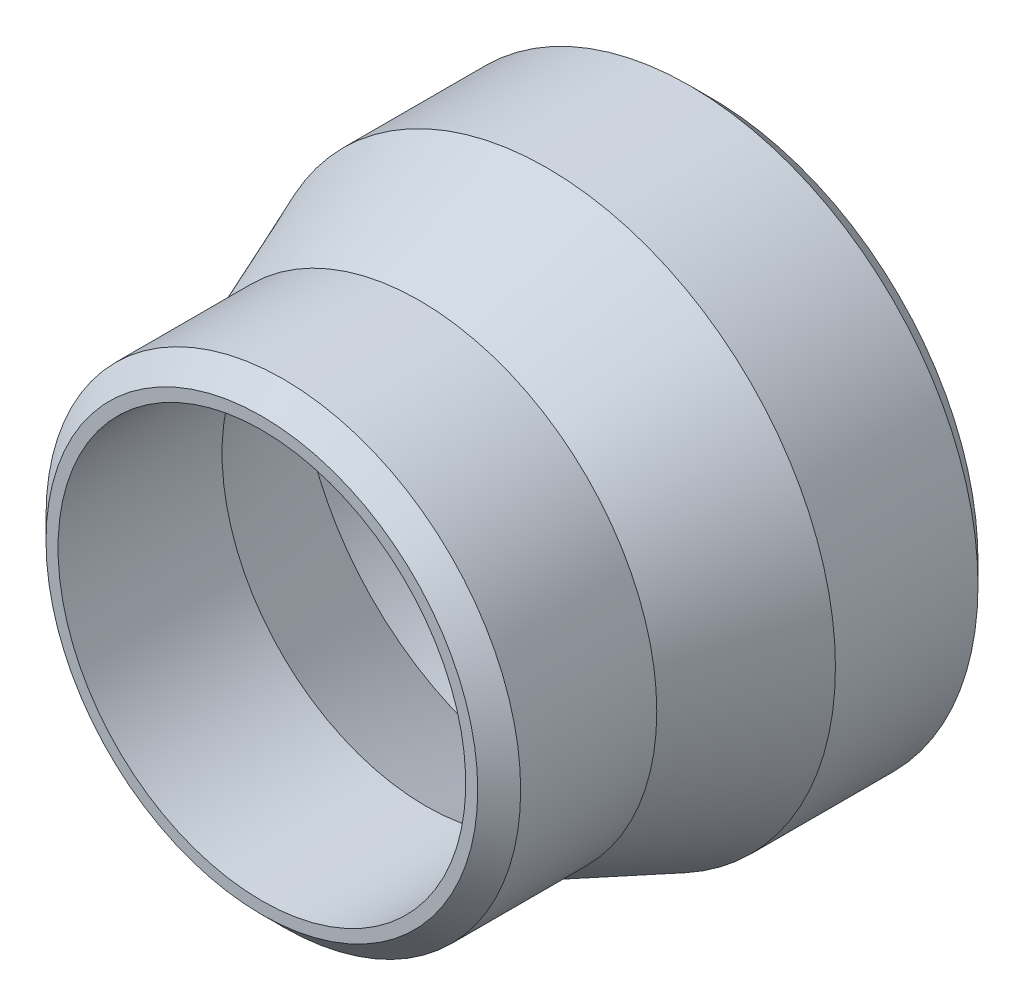
ISO-10303-21;
HEADER;
FILE_DESCRIPTION(('STEP AP214'),'2;1');
FILE_NAME('part.step','',(''),(''),'','','');
FILE_SCHEMA(('AUTOMOTIVE_DESIGN { 1 0 10303 214 1 1 1 1 }'));
ENDSEC;
DATA;
#1=APPLICATION_CONTEXT('core data for automotive mechanical design processes');
#2=APPLICATION_PROTOCOL_DEFINITION('international standard','automotive_design',2000,#1);
#3=PRODUCT_CONTEXT('',#1,'mechanical');
#4=PRODUCT('Part','Part','',(#3));
#5=PRODUCT_RELATED_PRODUCT_CATEGORY('part','',(#4));
#6=PRODUCT_DEFINITION_FORMATION('','',#4);
#7=PRODUCT_DEFINITION_CONTEXT('part definition',#1,'design');
#8=PRODUCT_DEFINITION('design','',#6,#7);
#9=PRODUCT_DEFINITION_SHAPE('','',#8);
#10=(LENGTH_UNIT() NAMED_UNIT(*) SI_UNIT(.MILLI.,.METRE.));
#11=(NAMED_UNIT(*) PLANE_ANGLE_UNIT() SI_UNIT($,.RADIAN.));
#12=(NAMED_UNIT(*) SI_UNIT($,.STERADIAN.) SOLID_ANGLE_UNIT());
#13=UNCERTAINTY_MEASURE_WITH_UNIT(LENGTH_MEASURE(1.E-05),#10,'distance_accuracy_value','');
#14=(GEOMETRIC_REPRESENTATION_CONTEXT(3) GLOBAL_UNCERTAINTY_ASSIGNED_CONTEXT((#13)) GLOBAL_UNIT_ASSIGNED_CONTEXT((#10,
#11,#12)) REPRESENTATION_CONTEXT('',''));
#15=CARTESIAN_POINT('',(0.,0.,0.));
#16=DIRECTION('',(0.,0.,1.));
#17=DIRECTION('',(1.,0.,0.));
#18=AXIS2_PLACEMENT_3D('',#15,#16,#17);
#19=CARTESIAN_POINT('',(0.,-1.86260373221868E-13,53.18125));
#20=DIRECTION('',(0.,0.,-1.));
#21=DIRECTION('',(0.,1.,0.));
#22=AXIS2_PLACEMENT_3D('',#19,#20,#21);
#23=PLANE('',#22);
#24=CARTESIAN_POINT('',(0.,0.,53.18125));
#25=DIRECTION('',(0.,0.,-1.));
#26=DIRECTION('',(0.,1.,0.));
#27=AXIS2_PLACEMENT_3D('',#24,#25,#26);
#28=CIRCLE('',#27,25.5524);
#29=CARTESIAN_POINT('',(0.,25.5524,53.18125));
#30=VERTEX_POINT('',#29);
#31=EDGE_CURVE('E10',#30,#30,#28,.F.);
#32=ORIENTED_EDGE('',*,*,#31,.T.);
#33=EDGE_LOOP('',(#32));
#34=FACE_BOUND('',#33,.T.);
#35=CARTESIAN_POINT('',(0.,0.,53.18125));
#36=DIRECTION('',(0.,0.,-1.));
#37=DIRECTION('',(0.,1.,0.));
#38=AXIS2_PLACEMENT_3D('',#35,#36,#37);
#39=CIRCLE('',#38,24.13);
#40=CARTESIAN_POINT('',(0.,24.13,53.18125));
#41=VERTEX_POINT('',#40);
#42=EDGE_CURVE('E52',#41,#41,#39,.T.);
#43=ORIENTED_EDGE('',*,*,#42,.T.);
#44=EDGE_LOOP('',(#43));
#45=FACE_BOUND('',#44,.T.);
#46=ADVANCED_FACE('F32',(#34,#45),#23,.F.);
#47=CARTESIAN_POINT('',(0.,0.,0.));
#48=DIRECTION('',(0.,0.,-1.));
#49=DIRECTION('',(0.,1.,0.));
#50=AXIS2_PLACEMENT_3D('',#47,#48,#49);
#51=CYLINDRICAL_SURFACE('',#50,24.13);
#52=ORIENTED_EDGE('',*,*,#42,.F.);
#53=EDGE_LOOP('',(#52));
#54=FACE_BOUND('',#53,.T.);
#55=CARTESIAN_POINT('',(0.,0.,33.766544931154));
#56=DIRECTION('',(0.,0.,-1.));
#57=DIRECTION('',(0.,1.,0.));
#58=AXIS2_PLACEMENT_3D('',#55,#56,#57);
#59=CIRCLE('',#58,24.13);
#60=CARTESIAN_POINT('',(0.,24.13,33.766544931154));
#61=VERTEX_POINT('',#60);
#62=EDGE_CURVE('E55',#61,#61,#59,.T.);
#63=ORIENTED_EDGE('',*,*,#62,.T.);
#64=EDGE_LOOP('',(#63));
#65=FACE_BOUND('',#64,.T.);
#66=ADVANCED_FACE('F86',(#54,#65),#51,.F.);
#67=CARTESIAN_POINT('',(0.,0.,18.653125));
#68=DIRECTION('',(0.,0.,-1.));
#69=DIRECTION('',(0.,1.,0.));
#70=AXIS2_PLACEMENT_3D('',#67,#68,#69);
#71=CONICAL_SURFACE('',#70,30.1625,0.379772172967996);
#72=ORIENTED_EDGE('',*,*,#62,.F.);
#73=EDGE_LOOP('',(#72));
#74=FACE_BOUND('',#73,.T.);
#75=CARTESIAN_POINT('',(0.,0.,18.653125));
#76=DIRECTION('',(0.,0.,-1.));
#77=DIRECTION('',(0.,1.,0.));
#78=AXIS2_PLACEMENT_3D('',#75,#76,#77);
#79=CIRCLE('',#78,30.1625);
#80=CARTESIAN_POINT('',(0.,30.1625,18.653125));
#81=VERTEX_POINT('',#80);
#82=EDGE_CURVE('E58',#81,#81,#79,.T.);
#83=ORIENTED_EDGE('',*,*,#82,.T.);
#84=EDGE_LOOP('',(#83));
#85=FACE_BOUND('',#84,.T.);
#86=ADVANCED_FACE('F91',(#74,#85),#71,.F.);
#87=CARTESIAN_POINT('',(0.,0.,0.));
#88=DIRECTION('',(0.,0.,-1.));
#89=DIRECTION('',(0.,1.,0.));
#90=AXIS2_PLACEMENT_3D('',#87,#88,#89);
#91=CYLINDRICAL_SURFACE('',#90,30.1625);
#92=ORIENTED_EDGE('',*,*,#82,.F.);
#93=EDGE_LOOP('',(#92));
#94=FACE_BOUND('',#93,.T.);
#95=CARTESIAN_POINT('',(0.,0.,0.));
#96=DIRECTION('',(0.,0.,-1.));
#97=DIRECTION('',(0.,1.,0.));
#98=AXIS2_PLACEMENT_3D('',#95,#96,#97);
#99=CIRCLE('',#98,30.1625);
#100=CARTESIAN_POINT('',(0.,30.1625,0.));
#101=VERTEX_POINT('',#100);
#102=EDGE_CURVE('E61',#101,#101,#99,.T.);
#103=ORIENTED_EDGE('',*,*,#102,.T.);
#104=EDGE_LOOP('',(#103));
#105=FACE_BOUND('',#104,.T.);
#106=ADVANCED_FACE('F98',(#94,#105),#91,.F.);
#107=CARTESIAN_POINT('',(0.,0.,0.));
#108=DIRECTION('',(0.,0.,1.));
#109=DIRECTION('',(0.,-1.,0.));
#110=AXIS2_PLACEMENT_3D('',#107,#108,#109);
#111=PLANE('',#110);
#112=CARTESIAN_POINT('',(0.,0.,0.));
#113=DIRECTION('',(0.,0.,1.));
#114=DIRECTION('',(0.,-1.,0.));
#115=AXIS2_PLACEMENT_3D('',#112,#113,#114);
#116=CIRCLE('',#115,31.5849);
#117=CARTESIAN_POINT('',(0.,-31.5849,0.));
#118=VERTEX_POINT('',#117);
#119=EDGE_CURVE('E47',#118,#118,#116,.F.);
#120=ORIENTED_EDGE('',*,*,#119,.T.);
#121=EDGE_LOOP('',(#120));
#122=FACE_BOUND('',#121,.T.);
#123=ORIENTED_EDGE('',*,*,#102,.F.);
#124=EDGE_LOOP('',(#123));
#125=FACE_BOUND('',#124,.T.);
#126=ADVANCED_FACE('F102',(#122,#125),#111,.F.);
#127=CARTESIAN_POINT('',(0.,0.,0.));
#128=DIRECTION('',(0.,0.,-1.));
#129=DIRECTION('',(0.,1.,0.));
#130=AXIS2_PLACEMENT_3D('',#127,#128,#129);
#131=CYLINDRICAL_SURFACE('',#130,34.1249);
#132=CARTESIAN_POINT('',(0.,0.,2.53999999999996));
#133=DIRECTION('',(0.,0.,1.));
#134=DIRECTION('',(0.,-1.,0.));
#135=AXIS2_PLACEMENT_3D('',#132,#133,#134);
#136=CIRCLE('',#135,34.1249);
#137=CARTESIAN_POINT('',(0.,-34.1249,2.53999999999995));
#138=VERTEX_POINT('',#137);
#139=EDGE_CURVE('E43',#138,#138,#136,.T.);
#140=ORIENTED_EDGE('',*,*,#139,.T.);
#141=EDGE_LOOP('',(#140));
#142=FACE_BOUND('',#141,.T.);
#143=CARTESIAN_POINT('',(0.,0.,19.414705068846));
#144=DIRECTION('',(0.,0.,-1.));
#145=DIRECTION('',(0.,1.,0.));
#146=AXIS2_PLACEMENT_3D('',#143,#144,#145);
#147=CIRCLE('',#146,34.1249);
#148=CARTESIAN_POINT('',(0.,34.1249,19.414705068846));
#149=VERTEX_POINT('',#148);
#150=EDGE_CURVE('E64',#149,#149,#147,.T.);
#151=ORIENTED_EDGE('',*,*,#150,.T.);
#152=EDGE_LOOP('',(#151));
#153=FACE_BOUND('',#152,.T.);
#154=ADVANCED_FACE('F82',(#142,#153),#131,.T.);
#155=CARTESIAN_POINT('',(0.,0.,34.528125));
#156=DIRECTION('',(0.,0.,-1.));
#157=DIRECTION('',(0.,1.,0.));
#158=AXIS2_PLACEMENT_3D('',#155,#156,#157);
#159=CONICAL_SURFACE('',#158,28.0924,0.379772172967994);
#160=ORIENTED_EDGE('',*,*,#150,.F.);
#161=EDGE_LOOP('',(#160));
#162=FACE_BOUND('',#161,.T.);
#163=CARTESIAN_POINT('',(0.,0.,34.528125));
#164=DIRECTION('',(0.,0.,-1.));
#165=DIRECTION('',(0.,1.,0.));
#166=AXIS2_PLACEMENT_3D('',#163,#164,#165);
#167=CIRCLE('',#166,28.0924);
#168=CARTESIAN_POINT('',(0.,28.0924,34.528125));
#169=VERTEX_POINT('',#168);
#170=EDGE_CURVE('E67',#169,#169,#167,.T.);
#171=ORIENTED_EDGE('',*,*,#170,.T.);
#172=EDGE_LOOP('',(#171));
#173=FACE_BOUND('',#172,.T.);
#174=ADVANCED_FACE('F71',(#162,#173),#159,.T.);
#175=CARTESIAN_POINT('',(0.,0.,0.));
#176=DIRECTION('',(0.,0.,-1.));
#177=DIRECTION('',(0.,1.,0.));
#178=AXIS2_PLACEMENT_3D('',#175,#176,#177);
#179=CYLINDRICAL_SURFACE('',#178,28.0924);
#180=CARTESIAN_POINT('',(0.,0.,50.64125));
#181=DIRECTION('',(0.,0.,-1.));
#182=DIRECTION('',(0.,1.,0.));
#183=AXIS2_PLACEMENT_3D('',#180,#181,#182);
#184=CIRCLE('',#183,28.0924);
#185=CARTESIAN_POINT('',(0.,28.0924,50.64125));
#186=VERTEX_POINT('',#185);
#187=EDGE_CURVE('E39',#186,#186,#184,.T.);
#188=ORIENTED_EDGE('',*,*,#187,.T.);
#189=EDGE_LOOP('',(#188));
#190=FACE_BOUND('',#189,.T.);
#191=ORIENTED_EDGE('',*,*,#170,.F.);
#192=EDGE_LOOP('',(#191));
#193=FACE_BOUND('',#192,.T.);
#194=ADVANCED_FACE('F73',(#190,#193),#179,.T.);
#195=CARTESIAN_POINT('',(0.,0.,0.));
#196=DIRECTION('',(0.,0.,1.));
#197=DIRECTION('',(0.,-1.,0.));
#198=AXIS2_PLACEMENT_3D('',#195,#196,#197);
#199=CONICAL_SURFACE('',#198,31.5849,0.785398163397447);
#200=ORIENTED_EDGE('',*,*,#139,.F.);
#201=EDGE_LOOP('',(#200));
#202=FACE_BOUND('',#201,.T.);
#203=ORIENTED_EDGE('',*,*,#119,.F.);
#204=EDGE_LOOP('',(#203));
#205=FACE_BOUND('',#204,.T.);
#206=ADVANCED_FACE('F75',(#202,#205),#199,.T.);
#207=CARTESIAN_POINT('',(0.,0.,50.64125));
#208=DIRECTION('',(0.,0.,-1.));
#209=DIRECTION('',(0.,1.,0.));
#210=AXIS2_PLACEMENT_3D('',#207,#208,#209);
#211=CONICAL_SURFACE('',#210,28.0924,0.785398163397452);
#212=ORIENTED_EDGE('',*,*,#31,.F.);
#213=EDGE_LOOP('',(#212));
#214=FACE_BOUND('',#213,.T.);
#215=ORIENTED_EDGE('',*,*,#187,.F.);
#216=EDGE_LOOP('',(#215));
#217=FACE_BOUND('',#216,.T.);
#218=ADVANCED_FACE('F34',(#214,#217),#211,.T.);
#219=CLOSED_SHELL('',(#46,#66,#86,#106,#126,#154,#174,#194,#206,#218));
#220=MANIFOLD_SOLID_BREP('B2',#219);
#221=ADVANCED_BREP_SHAPE_REPRESENTATION('',(#18,#220),#14);
#222=SHAPE_DEFINITION_REPRESENTATION(#9,#221);
ENDSEC;
END-ISO-10303-21;
